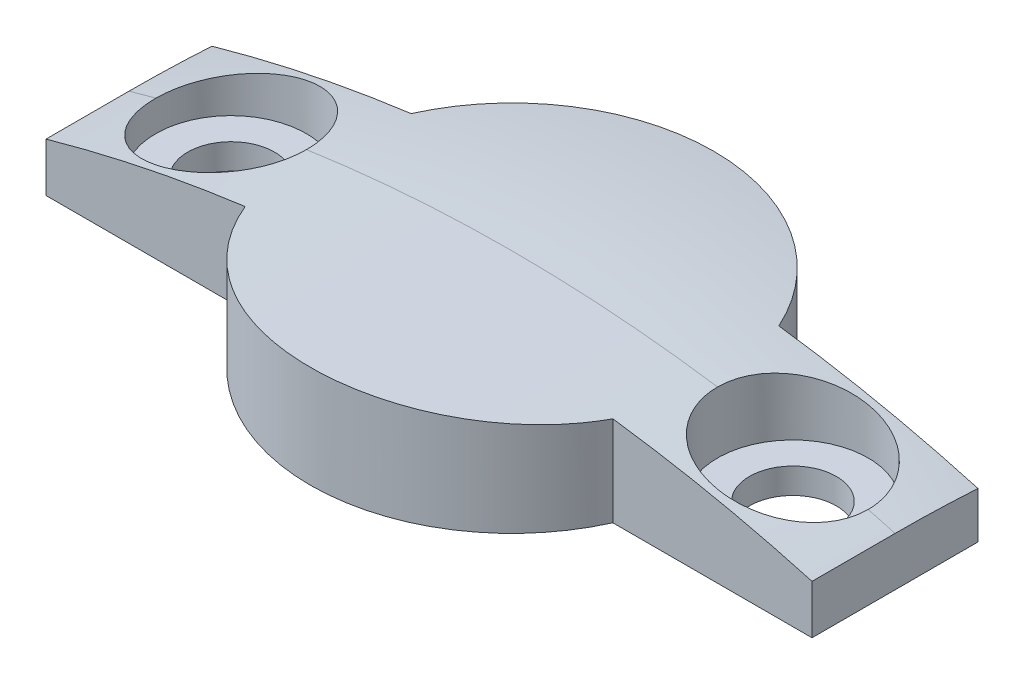
ISO-10303-21;
HEADER;
FILE_DESCRIPTION(('STEP AP214'),'2;1');
FILE_NAME('part.step','',(''),(''),'','','');
FILE_SCHEMA(('AUTOMOTIVE_DESIGN { 1 0 10303 214 1 1 1 1 }'));
ENDSEC;
DATA;
#1=APPLICATION_CONTEXT('core data for automotive mechanical design processes');
#2=APPLICATION_PROTOCOL_DEFINITION('international standard','automotive_design',2000,#1);
#3=PRODUCT_CONTEXT('',#1,'mechanical');
#4=PRODUCT('Part','Part','',(#3));
#5=PRODUCT_RELATED_PRODUCT_CATEGORY('part','',(#4));
#6=PRODUCT_DEFINITION_FORMATION('','',#4);
#7=PRODUCT_DEFINITION_CONTEXT('part definition',#1,'design');
#8=PRODUCT_DEFINITION('design','',#6,#7);
#9=PRODUCT_DEFINITION_SHAPE('','',#8);
#10=(LENGTH_UNIT() NAMED_UNIT(*) SI_UNIT(.MILLI.,.METRE.));
#11=(NAMED_UNIT(*) PLANE_ANGLE_UNIT() SI_UNIT($,.RADIAN.));
#12=(NAMED_UNIT(*) SI_UNIT($,.STERADIAN.) SOLID_ANGLE_UNIT());
#13=UNCERTAINTY_MEASURE_WITH_UNIT(LENGTH_MEASURE(1.E-05),#10,'distance_accuracy_value','');
#14=(GEOMETRIC_REPRESENTATION_CONTEXT(3) GLOBAL_UNCERTAINTY_ASSIGNED_CONTEXT((#13)) GLOBAL_UNIT_ASSIGNED_CONTEXT((#10,
#11,#12)) REPRESENTATION_CONTEXT('',''));
#15=CARTESIAN_POINT('',(0.,0.,0.));
#16=DIRECTION('',(0.,0.,1.));
#17=DIRECTION('',(1.,0.,0.));
#18=AXIS2_PLACEMENT_3D('',#15,#16,#17);
#19=CARTESIAN_POINT('',(-15.,4.,3.25));
#20=DIRECTION('',(1.,0.,0.));
#21=DIRECTION('',(0.,0.,-1.));
#22=AXIS2_PLACEMENT_3D('',#19,#20,#21);
#23=PLANE('',#22);
#24=CARTESIAN_POINT('',(-15.,-51.,0.));
#25=DIRECTION('',(1.,0.,0.));
#26=DIRECTION('',(0.,0.,-1.));
#27=AXIS2_PLACEMENT_3D('',#24,#25,#26);
#28=CIRCLE('',#27,52.9150262212918);
#29=CARTESIAN_POINT('',(-15.,1.81512567437476,-3.25));
#30=VERTEX_POINT('',#29);
#31=CARTESIAN_POINT('',(-15.,1.91502622129181,0.));
#32=VERTEX_POINT('',#31);
#33=EDGE_CURVE('E152',#30,#32,#28,.T.);
#34=ORIENTED_EDGE('',*,*,#33,.F.);
#35=DIRECTION('',(0.,-1.,0.));
#36=VECTOR('',#35,1.);
#37=CARTESIAN_POINT('',(-15.,4.,-3.25));
#38=LINE('',#37,#36);
#39=CARTESIAN_POINT('',(-15.,0.,-3.25));
#40=VERTEX_POINT('',#39);
#41=EDGE_CURVE('E210',#30,#40,#38,.T.);
#42=ORIENTED_EDGE('',*,*,#41,.T.);
#43=DIRECTION('',(0.,0.,1.));
#44=VECTOR('',#43,1.);
#45=CARTESIAN_POINT('',(-15.,0.,3.25));
#46=LINE('',#45,#44);
#47=CARTESIAN_POINT('',(-15.,0.,3.25));
#48=VERTEX_POINT('',#47);
#49=EDGE_CURVE('E174',#40,#48,#46,.T.);
#50=ORIENTED_EDGE('',*,*,#49,.T.);
#51=DIRECTION('',(0.,-1.,0.));
#52=VECTOR('',#51,1.);
#53=CARTESIAN_POINT('',(-15.,4.,3.25));
#54=LINE('',#53,#52);
#55=CARTESIAN_POINT('',(-15.,1.91502622129181,3.25));
#56=VERTEX_POINT('',#55);
#57=EDGE_CURVE('E230',#56,#48,#54,.T.);
#58=ORIENTED_EDGE('',*,*,#57,.F.);
#59=DIRECTION('',(0.,0.,1.));
#60=VECTOR('',#59,1.);
#61=CARTESIAN_POINT('',(-15.,1.91502622129181,21.725989645027));
#62=LINE('',#61,#60);
#63=EDGE_CURVE('E286',#32,#56,#62,.T.);
#64=ORIENTED_EDGE('',*,*,#63,.F.);
#65=EDGE_LOOP('',(#34,#42,#50,#58,#64));
#66=FACE_BOUND('',#65,.T.);
#67=ADVANCED_FACE('F39',(#66),#23,.F.);
#68=CARTESIAN_POINT('',(-7.20052081449669,4.,3.25));
#69=DIRECTION('',(0.,0.,-1.));
#70=DIRECTION('',(-1.,0.,0.));
#71=AXIS2_PLACEMENT_3D('',#68,#69,#70);
#72=PLANE('',#71);
#73=CARTESIAN_POINT('',(0.,-51.,3.25));
#74=DIRECTION('',(0.,0.,-1.));
#75=DIRECTION('',(-1.,0.,0.));
#76=AXIS2_PLACEMENT_3D('',#73,#74,#75);
#77=CIRCLE('',#76,55.);
#78=CARTESIAN_POINT('',(-7.20052081449669,3.52662193827893,3.25));
#79=VERTEX_POINT('',#78);
#80=EDGE_CURVE('E292',#56,#79,#77,.T.);
#81=ORIENTED_EDGE('',*,*,#80,.F.);
#82=ORIENTED_EDGE('',*,*,#57,.T.);
#83=DIRECTION('',(1.,0.,0.));
#84=VECTOR('',#83,1.);
#85=CARTESIAN_POINT('',(-7.20052081449669,0.,3.25));
#86=LINE('',#85,#84);
#87=CARTESIAN_POINT('',(-7.20052081449669,0.,3.24999999999999));
#88=VERTEX_POINT('',#87);
#89=EDGE_CURVE('E183',#48,#88,#86,.T.);
#90=ORIENTED_EDGE('',*,*,#89,.T.);
#91=DIRECTION('',(0.,-1.,0.));
#92=VECTOR('',#91,1.);
#93=CARTESIAN_POINT('',(-7.20052081449669,4.,3.24999999999999));
#94=LINE('',#93,#92);
#95=EDGE_CURVE('E227',#79,#88,#94,.T.);
#96=ORIENTED_EDGE('',*,*,#95,.F.);
#97=EDGE_LOOP('',(#81,#82,#90,#96));
#98=FACE_BOUND('',#97,.T.);
#99=ADVANCED_FACE('F310',(#98),#72,.F.);
#100=CARTESIAN_POINT('',(0.,4.,0.));
#101=DIRECTION('',(0.,-1.,0.));
#102=DIRECTION('',(0.,0.,-1.));
#103=AXIS2_PLACEMENT_3D('',#100,#101,#102);
#104=CYLINDRICAL_SURFACE('',#103,7.9);
#105=CARTESIAN_POINT('',(-7.20052081449669,3.52662193827893,3.25));
#106=CARTESIAN_POINT('',(-7.10892933307068,3.53871267946528,3.45298082942461));
#107=CARTESIAN_POINT('',(-7.00873825517564,3.55171307594968,3.65201756219289));
#108=CARTESIAN_POINT('',(-6.79198193762158,3.57912638849703,4.04084420545848));
#109=CARTESIAN_POINT('',(-6.67541801523197,3.59353919089735,4.23063485819191));
#110=CARTESIAN_POINT('',(-6.42680746034521,3.62336283278068,4.59952298712499));
#111=CARTESIAN_POINT('',(-6.29477101475349,3.63877301264421,4.77862738307223));
#112=CARTESIAN_POINT('',(-6.01609576883491,3.67015873150038,5.12503653674881));
#113=CARTESIAN_POINT('',(-5.86945699231025,3.68613426957145,5.29234131371108));
#114=CARTESIAN_POINT('',(-5.56257866333644,3.71820093139533,5.61401283283452));
#115=CARTESIAN_POINT('',(-5.40233696229129,3.73429207303907,5.76837752341408));
#116=CARTESIAN_POINT('',(-5.06932769329573,3.76613824274754,6.06311601490023));
#117=CARTESIAN_POINT('',(-4.8965555232747,3.78189314454364,6.20348463005337));
#118=CARTESIAN_POINT('',(-4.5398044727223,3.81260995682263,6.46912796690498));
#119=CARTESIAN_POINT('',(-4.35582970185931,3.82757215438646,6.59440817414911));
#120=CARTESIAN_POINT('',(-3.97789644482751,3.85628722572098,6.82904177405816));
#121=CARTESIAN_POINT('',(-3.78393785998935,3.87004008753625,6.938395009277));
#122=CARTESIAN_POINT('',(-3.38734177642489,3.89595076744591,7.14040992509419));
#123=CARTESIAN_POINT('',(-3.18470183582047,3.90810813280216,7.23306687072316));
#124=CARTESIAN_POINT('',(-2.77222213300346,3.93047824206728,7.40097074128448));
#125=CARTESIAN_POINT('',(-2.56238219531649,3.94069093854197,7.47621724155242));
#126=CARTESIAN_POINT('',(-2.13702920178557,3.95887927229919,7.6087266602855));
#127=CARTESIAN_POINT('',(-1.92151678232436,3.96685515936402,7.66599158682069));
#128=CARTESIAN_POINT('',(-1.48627331638825,3.98034565378057,7.76213100305915));
#129=CARTESIAN_POINT('',(-1.26654084763559,3.98585941558506,7.80099917519202));
#130=CARTESIAN_POINT('',(-0.82647841481528,3.99422639166739,7.85975668860282));
#131=CARTESIAN_POINT('',(-0.606170834396561,3.99710265463107,7.87981048220125));
#132=CARTESIAN_POINT('',(-0.16462828619901,4.00019671547024,7.90137669480423));
#133=CARTESIAN_POINT('',(0.0566066912141947,4.00041448565886,7.90288892070763));
#134=CARTESIAN_POINT('',(0.498394449817312,3.99818538604094,7.8873604039125));
#135=CARTESIAN_POINT('',(0.718947279762881,3.99573871130262,7.87032101940659));
#136=CARTESIAN_POINT('',(1.15780923681034,3.98825005514287,7.81782052054378));
#137=CARTESIAN_POINT('',(1.37611831729657,3.98320801991152,7.78235902423882));
#138=CARTESIAN_POINT('',(1.80781912769326,3.97070297706149,7.69351069661142));
#139=CARTESIAN_POINT('',(2.02123031071326,3.96325249618051,7.64021656657908));
#140=CARTESIAN_POINT('',(2.44285829642215,3.94612796297683,7.5160333955143));
#141=CARTESIAN_POINT('',(2.65107328365365,3.93645314524153,7.44513829717181));
#142=CARTESIAN_POINT('',(3.06071303050216,3.91515356629279,7.28630756217148));
#143=CARTESIAN_POINT('',(3.26214006924652,3.90352946756587,7.19837771340656));
#144=CARTESIAN_POINT('',(3.65696234462472,3.87864586976735,7.00605898057262));
#145=CARTESIAN_POINT('',(3.85035459884319,3.86538577055515,6.90166405262051));
#146=CARTESIAN_POINT('',(4.22887592957763,3.83751316794078,6.67648147318121));
#147=CARTESIAN_POINT('',(4.41394641119109,3.82289279724132,6.55559630002772));
#148=CARTESIAN_POINT('',(4.77326833246192,3.79277709195863,6.29878370267967));
#149=CARTESIAN_POINT('',(4.94751954376429,3.77728173892092,6.16285596116017));
#150=CARTESIAN_POINT('',(5.28397620106914,3.74585049724975,5.87693202798796));
#151=CARTESIAN_POINT('',(5.44618349891637,3.72991467686079,5.72693800719383));
#152=CARTESIAN_POINT('',(5.75747001675258,3.69804403525933,5.41389445279864));
#153=CARTESIAN_POINT('',(5.90654983075194,3.68210921403426,5.25084551056264));
#154=CARTESIAN_POINT('',(6.16490381189636,3.65352389999387,4.94334840043145));
#155=CARTESIAN_POINT('',(6.27650601749102,3.64079971521568,4.80085446003523));
#156=CARTESIAN_POINT('',(6.48968522639823,3.61589051987319,4.50851507419616));
#157=CARTESIAN_POINT('',(6.59126286931065,3.60370547493742,4.35867009868784));
#158=CARTESIAN_POINT('',(6.78384261080779,3.5801145414542,4.05242694193478));
#159=CARTESIAN_POINT('',(6.87485232640313,3.56870809419439,3.89603359256038));
#160=CARTESIAN_POINT('',(7.04597292241326,3.54687568915708,3.57729393987092));
#161=CARTESIAN_POINT('',(7.12608194387495,3.53644989870955,3.41494662717291));
#162=CARTESIAN_POINT('',(7.20052081449669,3.52662193827892,3.25));
#163=B_SPLINE_CURVE_WITH_KNOTS('',3,(#105,#106,#107,#108,#109,#110,#111,#112,#113,#114,#115,
#116,#117,#118,#119,#120,#121,#122,#123,#124,#125,#126,#127,#128,#129,#130,#131,#132,#133,#134,
#135,#136,#137,#138,#139,#140,#141,#142,#143,#144,#145,#146,#147,#148,#149,#150,#151,#152,#153,
#154,#155,#156,#157,#158,#159,#160,#161,#162),.UNSPECIFIED.,.F.,.F.,(4,2,2,2,2,2,2,2,2,2,2,2,2,
2,2,2,2,2,2,2,2,2,2,2,2,2,2,2,4),(0.,0.668837429769156,1.33762107933075,2.0059668586106,
2.67431154848736,3.34276200122433,4.01145921154448,4.67991257151661,5.34837253903617,
6.01702178053332,6.68568732957478,7.35427817963758,8.02309846205382,8.68601672664661,
9.34894189519523,10.0118185332113,10.6747089152839,11.3342055170579,11.9939293975997,
12.6534295158087,13.3131722844396,13.9770010765929,14.6408438749707,15.3045843901068,
15.9682948559522,16.5122139583908,17.0560983345456,17.5995882311397,18.1431706960965),.UNSPECIFIED.);
#164=CARTESIAN_POINT('',(7.20052081449669,3.52662193827893,3.25));
#165=VERTEX_POINT('',#164);
#166=EDGE_CURVE('E136',#79,#165,#163,.T.);
#167=ORIENTED_EDGE('',*,*,#166,.F.);
#168=ORIENTED_EDGE('',*,*,#95,.T.);
#169=CARTESIAN_POINT('',(0.,0.,0.));
#170=DIRECTION('',(0.,1.,0.));
#171=DIRECTION('',(0.,0.,1.));
#172=AXIS2_PLACEMENT_3D('',#169,#170,#171);
#173=CIRCLE('',#172,7.9);
#174=CARTESIAN_POINT('',(7.20052081449668,0.,3.25));
#175=VERTEX_POINT('',#174);
#176=EDGE_CURVE('E187',#88,#175,#173,.T.);
#177=ORIENTED_EDGE('',*,*,#176,.T.);
#178=DIRECTION('',(0.,-1.,0.));
#179=VECTOR('',#178,1.);
#180=CARTESIAN_POINT('',(7.20052081449668,4.,3.25));
#181=LINE('',#180,#179);
#182=EDGE_CURVE('E224',#165,#175,#181,.T.);
#183=ORIENTED_EDGE('',*,*,#182,.F.);
#184=EDGE_LOOP('',(#167,#168,#177,#183));
#185=FACE_BOUND('',#184,.T.);
#186=ADVANCED_FACE('F321',(#185),#104,.T.);
#187=CARTESIAN_POINT('',(15.,4.,3.25));
#188=DIRECTION('',(0.,0.,-1.));
#189=DIRECTION('',(-1.,0.,0.));
#190=AXIS2_PLACEMENT_3D('',#187,#188,#189);
#191=PLANE('',#190);
#192=CARTESIAN_POINT('',(0.,-51.,3.25));
#193=DIRECTION('',(0.,0.,-1.));
#194=DIRECTION('',(-1.,0.,0.));
#195=AXIS2_PLACEMENT_3D('',#192,#193,#194);
#196=CIRCLE('',#195,55.);
#197=CARTESIAN_POINT('',(15.,1.91502622129181,3.25));
#198=VERTEX_POINT('',#197);
#199=EDGE_CURVE('E131',#165,#198,#196,.T.);
#200=ORIENTED_EDGE('',*,*,#199,.F.);
#201=ORIENTED_EDGE('',*,*,#182,.T.);
#202=DIRECTION('',(1.,0.,0.));
#203=VECTOR('',#202,1.);
#204=CARTESIAN_POINT('',(15.,0.,3.25));
#205=LINE('',#204,#203);
#206=CARTESIAN_POINT('',(15.,0.,3.25));
#207=VERTEX_POINT('',#206);
#208=EDGE_CURVE('E191',#175,#207,#205,.T.);
#209=ORIENTED_EDGE('',*,*,#208,.T.);
#210=DIRECTION('',(0.,-1.,0.));
#211=VECTOR('',#210,1.);
#212=CARTESIAN_POINT('',(15.,4.,3.25));
#213=LINE('',#212,#211);
#214=EDGE_CURVE('E221',#198,#207,#213,.T.);
#215=ORIENTED_EDGE('',*,*,#214,.F.);
#216=EDGE_LOOP('',(#200,#201,#209,#215));
#217=FACE_BOUND('',#216,.T.);
#218=ADVANCED_FACE('F323',(#217),#191,.F.);
#219=CARTESIAN_POINT('',(15.,4.,3.25));
#220=DIRECTION('',(-1.,0.,0.));
#221=DIRECTION('',(0.,0.,1.));
#222=AXIS2_PLACEMENT_3D('',#219,#220,#221);
#223=PLANE('',#222);
#224=CARTESIAN_POINT('',(15.,-51.,0.));
#225=DIRECTION('',(-1.,0.,0.));
#226=DIRECTION('',(0.,0.,1.));
#227=AXIS2_PLACEMENT_3D('',#224,#225,#226);
#228=CIRCLE('',#227,52.9150262212918);
#229=CARTESIAN_POINT('',(15.,1.91502622129181,0.));
#230=VERTEX_POINT('',#229);
#231=CARTESIAN_POINT('',(15.,1.81512567437476,-3.25));
#232=VERTEX_POINT('',#231);
#233=EDGE_CURVE('E139',#230,#232,#228,.T.);
#234=ORIENTED_EDGE('',*,*,#233,.F.);
#235=DIRECTION('',(0.,0.,1.));
#236=VECTOR('',#235,1.);
#237=CARTESIAN_POINT('',(15.,1.91502622129181,21.725989645027));
#238=LINE('',#237,#236);
#239=EDGE_CURVE('E126',#198,#230,#238,.F.);
#240=ORIENTED_EDGE('',*,*,#239,.F.);
#241=ORIENTED_EDGE('',*,*,#214,.T.);
#242=DIRECTION('',(0.,0.,-1.));
#243=VECTOR('',#242,1.);
#244=CARTESIAN_POINT('',(15.,0.,3.25));
#245=LINE('',#244,#243);
#246=CARTESIAN_POINT('',(15.,0.,-3.25));
#247=VERTEX_POINT('',#246);
#248=EDGE_CURVE('E195',#207,#247,#245,.T.);
#249=ORIENTED_EDGE('',*,*,#248,.T.);
#250=DIRECTION('',(0.,-1.,0.));
#251=VECTOR('',#250,1.);
#252=CARTESIAN_POINT('',(15.,4.,-3.25));
#253=LINE('',#252,#251);
#254=EDGE_CURVE('E150',#232,#247,#253,.T.);
#255=ORIENTED_EDGE('',*,*,#254,.F.);
#256=EDGE_LOOP('',(#234,#240,#241,#249,#255));
#257=FACE_BOUND('',#256,.T.);
#258=ADVANCED_FACE('F148',(#257),#223,.F.);
#259=CARTESIAN_POINT('',(15.,4.,-3.25));
#260=DIRECTION('',(0.,0.,1.));
#261=DIRECTION('',(1.,0.,0.));
#262=AXIS2_PLACEMENT_3D('',#259,#260,#261);
#263=PLANE('',#262);
#264=CARTESIAN_POINT('',(0.,-51.,-3.25));
#265=DIRECTION('',(0.,0.,1.));
#266=DIRECTION('',(1.,0.,0.));
#267=AXIS2_PLACEMENT_3D('',#264,#265,#266);
#268=CIRCLE('',#267,54.9038933045736);
#269=CARTESIAN_POINT('',(7.20052081449669,3.42967940379587,-3.25));
#270=VERTEX_POINT('',#269);
#271=EDGE_CURVE('E153',#232,#270,#268,.T.);
#272=ORIENTED_EDGE('',*,*,#271,.F.);
#273=ORIENTED_EDGE('',*,*,#254,.T.);
#274=DIRECTION('',(-1.,0.,0.));
#275=VECTOR('',#274,1.);
#276=CARTESIAN_POINT('',(15.,0.,-3.25));
#277=LINE('',#276,#275);
#278=CARTESIAN_POINT('',(7.20052081449669,0.,-3.25));
#279=VERTEX_POINT('',#278);
#280=EDGE_CURVE('E198',#247,#279,#277,.T.);
#281=ORIENTED_EDGE('',*,*,#280,.T.);
#282=DIRECTION('',(0.,-1.,0.));
#283=VECTOR('',#282,1.);
#284=CARTESIAN_POINT('',(7.20052081449669,4.,-3.25));
#285=LINE('',#284,#283);
#286=EDGE_CURVE('E216',#270,#279,#285,.T.);
#287=ORIENTED_EDGE('',*,*,#286,.F.);
#288=EDGE_LOOP('',(#272,#273,#281,#287));
#289=FACE_BOUND('',#288,.T.);
#290=ADVANCED_FACE('F328',(#289),#263,.F.);
#291=CARTESIAN_POINT('',(0.,4.,0.));
#292=DIRECTION('',(0.,-1.,0.));
#293=DIRECTION('',(0.,0.,-1.));
#294=AXIS2_PLACEMENT_3D('',#291,#292,#293);
#295=CYLINDRICAL_SURFACE('',#294,7.9);
#296=CARTESIAN_POINT('',(0.,3.42967940379587,0.));
#297=DIRECTION('',(0.,-1.,0.));
#298=DIRECTION('',(0.,0.,-1.));
#299=AXIS2_PLACEMENT_3D('',#296,#297,#298);
#300=CIRCLE('',#299,7.9);
#301=CARTESIAN_POINT('',(-7.20052081449669,3.42967940379586,-3.25));
#302=VERTEX_POINT('',#301);
#303=EDGE_CURVE('E60',#270,#302,#300,.F.);
#304=ORIENTED_EDGE('',*,*,#303,.F.);
#305=ORIENTED_EDGE('',*,*,#286,.T.);
#306=CARTESIAN_POINT('',(0.,0.,0.));
#307=DIRECTION('',(0.,1.,0.));
#308=DIRECTION('',(0.,0.,1.));
#309=AXIS2_PLACEMENT_3D('',#306,#307,#308);
#310=CIRCLE('',#309,7.9);
#311=CARTESIAN_POINT('',(-7.20052081449669,0.,-3.25));
#312=VERTEX_POINT('',#311);
#313=EDGE_CURVE('E202',#279,#312,#310,.T.);
#314=ORIENTED_EDGE('',*,*,#313,.T.);
#315=DIRECTION('',(0.,-1.,0.));
#316=VECTOR('',#315,1.);
#317=CARTESIAN_POINT('',(-7.20052081449669,4.,-3.25));
#318=LINE('',#317,#316);
#319=EDGE_CURVE('E213',#302,#312,#318,.T.);
#320=ORIENTED_EDGE('',*,*,#319,.F.);
#321=EDGE_LOOP('',(#304,#305,#314,#320));
#322=FACE_BOUND('',#321,.T.);
#323=ADVANCED_FACE('F331',(#322),#295,.T.);
#324=CARTESIAN_POINT('',(-7.20052081449669,4.,-3.25));
#325=DIRECTION('',(0.,0.,1.));
#326=DIRECTION('',(1.,0.,0.));
#327=AXIS2_PLACEMENT_3D('',#324,#325,#326);
#328=PLANE('',#327);
#329=CARTESIAN_POINT('',(0.,-51.,-3.25));
#330=DIRECTION('',(0.,0.,1.));
#331=DIRECTION('',(1.,0.,0.));
#332=AXIS2_PLACEMENT_3D('',#329,#330,#331);
#333=CIRCLE('',#332,54.9038933045736);
#334=EDGE_CURVE('E285',#302,#30,#333,.T.);
#335=ORIENTED_EDGE('',*,*,#334,.F.);
#336=ORIENTED_EDGE('',*,*,#319,.T.);
#337=DIRECTION('',(-1.,0.,0.));
#338=VECTOR('',#337,1.);
#339=CARTESIAN_POINT('',(-7.20052081449669,0.,-3.25));
#340=LINE('',#339,#338);
#341=EDGE_CURVE('E206',#312,#40,#340,.T.);
#342=ORIENTED_EDGE('',*,*,#341,.T.);
#343=ORIENTED_EDGE('',*,*,#41,.F.);
#344=EDGE_LOOP('',(#335,#336,#342,#343));
#345=FACE_BOUND('',#344,.T.);
#346=ADVANCED_FACE('F271',(#345),#328,.F.);
#347=CARTESIAN_POINT('',(-11.,1.,0.));
#348=DIRECTION('',(0.,1.,0.));
#349=DIRECTION('',(0.,0.,1.));
#350=AXIS2_PLACEMENT_3D('',#347,#348,#349);
#351=CYLINDRICAL_SURFACE('',#350,2.95);
#352=CARTESIAN_POINT('',(-11.,1.,0.));
#353=DIRECTION('',(0.,1.,0.));
#354=DIRECTION('',(0.,0.,1.));
#355=AXIS2_PLACEMENT_3D('',#352,#353,#354);
#356=CIRCLE('',#355,2.95);
#357=CARTESIAN_POINT('',(-11.,1.,2.95));
#358=VERTEX_POINT('',#357);
#359=EDGE_CURVE('E162',#358,#358,#356,.T.);
#360=ORIENTED_EDGE('',*,*,#359,.F.);
#361=EDGE_LOOP('',(#360));
#362=FACE_BOUND('',#361,.T.);
#363=CARTESIAN_POINT('',(-13.9499999932203,2.20148024396645,0.000199999999999988));
#364=CARTESIAN_POINT('',(-13.9500143793869,2.20147721144173,-0.0815289670688059));
#365=CARTESIAN_POINT('',(-13.9466147392955,2.20218018156275,-0.163253862727753));
#366=CARTESIAN_POINT('',(-13.9330556013263,2.20498360467265,-0.326109691324551));
#367=CARTESIAN_POINT('',(-13.9228967107128,2.20708393212022,-0.407240676958494));
#368=CARTESIAN_POINT('',(-13.8959045931903,2.21266396567041,-0.568234282201102));
#369=CARTESIAN_POINT('',(-13.8790799570637,2.21614189632297,-0.648098397296882));
#370=CARTESIAN_POINT('',(-13.8389077072492,2.22444501850554,-0.806073900158508));
#371=CARTESIAN_POINT('',(-13.8155601202855,2.22927020451591,-0.884185295103753));
#372=CARTESIAN_POINT('',(-13.7359616220267,2.24571782181527,-1.11510668903725));
#373=CARTESIAN_POINT('',(-13.6701377403917,2.25931587737344,-1.26460585583815));
#374=CARTESIAN_POINT('',(-13.5150949197148,2.29132824529451,-1.55024089977089));
#375=CARTESIAN_POINT('',(-13.4258767908251,2.30974239087421,-1.68637723943846));
#376=CARTESIAN_POINT('',(-13.2257831665228,2.35101403757995,-1.94295623731438));
#377=CARTESIAN_POINT('',(-13.1147185269851,2.37391033562926,-2.0632453080618));
#378=CARTESIAN_POINT('',(-12.8747056369936,2.42335244195798,-2.28353451686057));
#379=CARTESIAN_POINT('',(-12.7457534785251,2.44989904773525,-2.38353020948123));
#380=CARTESIAN_POINT('',(-12.4709449276082,2.50642507747701,-2.56246425467045));
#381=CARTESIAN_POINT('',(-12.324807479537,2.5364614393376,-2.64095300449766));
#382=CARTESIAN_POINT('',(-12.0218653881034,2.59867002493081,-2.77228322283303));
#383=CARTESIAN_POINT('',(-11.8650603020131,2.63084233730825,-2.82512362614316));
#384=CARTESIAN_POINT('',(-11.5421368196058,2.69703534122329,-2.90460631991368));
#385=CARTESIAN_POINT('',(-11.3759003208929,2.73107911793124,-2.93075005909331));
#386=CARTESIAN_POINT('',(-11.0414609823659,2.79950305609478,-2.95446952418765));
#387=CARTESIAN_POINT('',(-10.8732579616417,2.83388324845073,-2.95204260075376));
#388=CARTESIAN_POINT('',(-10.5380267069855,2.90233849094292,-2.9185124493733));
#389=CARTESIAN_POINT('',(-10.3710236586973,2.93640779288851,-2.88714466121818));
#390=CARTESIAN_POINT('',(-10.0445662448825,3.00294575469703,-2.79613297113232));
#391=CARTESIAN_POINT('',(-9.8851118466893,3.03541442148672,-2.73648919157806));
#392=CARTESIAN_POINT('',(-9.57900505482259,3.09769270274096,-2.59073310034193));
#393=CARTESIAN_POINT('',(-9.43230555713591,3.12751211071551,-2.50472399501361));
#394=CARTESIAN_POINT('',(-9.15542753297029,3.18375112681731,-2.3084282504103));
#395=CARTESIAN_POINT('',(-9.02524699774058,3.21017114832466,-2.19814456745868));
#396=CARTESIAN_POINT('',(-8.787298494911,3.25843259680417,-1.95820377144027));
#397=CARTESIAN_POINT('',(-8.67921545753842,3.28033842994588,-1.82887214185874));
#398=CARTESIAN_POINT('',(-8.48634053814465,3.31941081559046,-1.55316144219824));
#399=CARTESIAN_POINT('',(-8.4015535669075,3.33657636885162,-1.40677878702877));
#400=CARTESIAN_POINT('',(-8.25945158245021,3.36533609580274,-1.10422568583936));
#401=CARTESIAN_POINT('',(-8.20164024195259,3.37703093672776,-0.948297205255498));
#402=CARTESIAN_POINT('',(-8.11304502727378,3.39495005170928,-0.628787660639243));
#403=CARTESIAN_POINT('',(-8.08221584619925,3.40118349624787,-0.465219912516979));
#404=CARTESIAN_POINT('',(-8.06021671464717,3.40563144116556,-0.250429033122879));
#405=CARTESIAN_POINT('',(-8.05638068403909,3.40640702165969,-0.2003402833859));
#406=CARTESIAN_POINT('',(-8.05127420346542,3.40743945469579,-0.100107898304989));
#407=CARTESIAN_POINT('',(-8.04999961914818,3.40769714315142,-0.0499644823241709));
#408=CARTESIAN_POINT('',(-8.05000000677966,3.40769706439381,0.000199999999999929));
#409=B_SPLINE_CURVE_WITH_KNOTS('',3,(#363,#364,#365,#366,#367,#368,#369,#370,#371,#372,#373,
#374,#375,#376,#377,#378,#379,#380,#381,#382,#383,#384,#385,#386,#387,#388,#389,#390,#391,#392,
#393,#394,#395,#396,#397,#398,#399,#400,#401,#402,#403,#404,#405,#406,#407,#408),.UNSPECIFIED.,
.F.,.F.,(4,2,2,2,2,2,2,2,2,2,2,2,2,2,2,2,2,2,2,2,2,2,4),(0.,0.245105330518067,0.490188643268912,
0.734957115928842,0.979724585798291,1.46895303791877,1.95816455009846,2.45181446385765,
2.9455723992251,3.44897762893489,3.9524037637114,4.46506818596224,4.97778014779882,
5.49522595733342,6.01266952741971,6.52811289940487,7.04349353188483,7.55091517605104,
8.05844370219738,8.55622513306347,9.05316910540555,9.20384671961335,9.35428093375512),.UNSPECIFIED.);
#410=CARTESIAN_POINT('',(-13.95,2.20148024256468,0.));
#411=VERTEX_POINT('',#410);
#412=CARTESIAN_POINT('',(-8.05,3.40769706576451,0.));
#413=VERTEX_POINT('',#412);
#414=EDGE_CURVE('E277',#411,#413,#409,.T.);
#415=ORIENTED_EDGE('',*,*,#414,.F.);
#416=CARTESIAN_POINT('',(-8.05,3.40769706576451,0.));
#417=CARTESIAN_POINT('',(-8.04999159944331,3.40769691427624,0.0822490715707013));
#418=CARTESIAN_POINT('',(-8.05343973162025,3.40718809703661,0.16449421322486));
#419=CARTESIAN_POINT('',(-8.06718423339113,3.40515257712504,0.32839263055902));
#420=CARTESIAN_POINT('',(-8.07748017701344,3.40362593776723,0.410045942734715));
#421=CARTESIAN_POINT('',(-8.1048427383,3.39955611626435,0.572111551857416));
#422=CARTESIAN_POINT('',(-8.12190304001028,3.39701388237416,0.652524933982193));
#423=CARTESIAN_POINT('',(-8.16264766326614,3.39091471448304,0.811592321019425));
#424=CARTESIAN_POINT('',(-8.18633192095323,3.38735779026426,0.890246342885161));
#425=CARTESIAN_POINT('',(-8.26710897049493,3.37515906141859,1.12279880160956));
#426=CARTESIAN_POINT('',(-8.33393960059146,3.36498732962078,1.27336741164972));
#427=CARTESIAN_POINT('',(-8.49145196618888,3.34060681639279,1.56096276515092));
#428=CARTESIAN_POINT('',(-8.58213017479976,3.3263986319008,1.69799150694453));
#429=CARTESIAN_POINT('',(-8.78502613041163,3.29395803200755,1.95533020270265));
#430=CARTESIAN_POINT('',(-8.8973194552977,3.27571146171077,2.07557886188342));
#431=CARTESIAN_POINT('',(-9.13991961730681,3.23538477562705,2.29552235368403));
#432=CARTESIAN_POINT('',(-9.27022977461058,3.21330395306344,2.39521338944479));
#433=CARTESIAN_POINT('',(-9.54648422721274,3.16534373906344,2.57235070189931));
#434=CARTESIAN_POINT('',(-9.69257533554121,3.13942766664117,2.64955802029524));
#435=CARTESIAN_POINT('',(-9.99504647864712,3.08440310694093,2.77841647540666));
#436=CARTESIAN_POINT('',(-10.1514266400165,3.05529458038148,2.83006729761973));
#437=CARTESIAN_POINT('',(-10.4725659219183,2.99400405883949,2.90723257690175));
#438=CARTESIAN_POINT('',(-10.6374170313433,2.96178161134514,2.9323319726343));
#439=CARTESIAN_POINT('',(-10.9686189731543,2.89543515310736,2.9545001442355));
#440=CARTESIAN_POINT('',(-11.1349699855672,2.86131091148286,2.95156550932295));
#441=CARTESIAN_POINT('',(-11.4672609212616,2.79155326384986,2.91761883106298));
#442=CARTESIAN_POINT('',(-11.6331521046139,2.75590447807051,2.88616037088498));
#443=CARTESIAN_POINT('',(-11.9571986038765,2.6847552064954,2.79545776346773));
#444=CARTESIAN_POINT('',(-12.11535339447,2.64925473091949,2.73621173227957));
#445=CARTESIAN_POINT('',(-12.4206116908337,2.57940943525239,2.59097162405674));
#446=CARTESIAN_POINT('',(-12.5676278289494,2.54507472617376,2.50478881051489));
#447=CARTESIAN_POINT('',(-12.8450598982132,2.47919963480671,2.30806507026631));
#448=CARTESIAN_POINT('',(-12.9754771053314,2.4476590377899,2.19752601762506));
#449=CARTESIAN_POINT('',(-13.2144379810207,2.38907784978075,1.95634144963129));
#450=CARTESIAN_POINT('',(-13.3232032026321,2.36199223127862,1.82592660397334));
#451=CARTESIAN_POINT('',(-13.5171579379429,2.31319238941095,1.54763294388282));
#452=CARTESIAN_POINT('',(-13.6023433957109,2.29147909020073,1.39975113120844));
#453=CARTESIAN_POINT('',(-13.7442725097872,2.25504877976585,1.09498680402735));
#454=CARTESIAN_POINT('',(-13.8017112740687,2.24016131660324,0.938447518442568));
#455=CARTESIAN_POINT('',(-13.8893974073233,2.21735368275126,0.617599490126873));
#456=CARTESIAN_POINT('',(-13.9196943604257,2.20942080761438,0.453305494755996));
#457=CARTESIAN_POINT('',(-13.9406223316103,2.2039383100218,0.239935642777048));
#458=CARTESIAN_POINT('',(-13.9441404502064,2.2030163335567,0.191981033002685));
#459=CARTESIAN_POINT('',(-13.9488259497056,2.20178818872947,0.0960242486693861));
#460=CARTESIAN_POINT('',(-13.9499969929418,2.20148106096957,0.0480222653295203));
#461=CARTESIAN_POINT('',(-13.95,2.20148024256467,0.));
#462=B_SPLINE_CURVE_WITH_KNOTS('',3,(#416,#417,#418,#419,#420,#421,#422,#423,#424,#425,#426,
#427,#428,#429,#430,#431,#432,#433,#434,#435,#436,#437,#438,#439,#440,#441,#442,#443,#444,#445,
#446,#447,#448,#449,#450,#451,#452,#453,#454,#455,#456,#457,#458,#459,#460,#461),.UNSPECIFIED.,
.F.,.F.,(4,2,2,2,2,2,2,2,2,2,2,2,2,2,2,2,2,2,2,2,2,2,4),(0.,0.246666351177186,0.493317359782429,
0.739738607982591,0.98615748063188,1.47875544048919,1.97128058948315,2.46556022055851,
2.9599310602582,3.45937888333604,3.95883285254773,4.46598402933837,4.97319690984005,
5.4884876691516,6.00381336932996,6.52283393073698,7.04181457058394,7.55517576416614,
8.06862520569491,8.56844201529091,9.06734385942323,9.21158010066772,9.35559110256061),.UNSPECIFIED.);
#463=EDGE_CURVE('E144',#413,#411,#462,.T.);
#464=ORIENTED_EDGE('',*,*,#463,.F.);
#465=EDGE_LOOP('',(#415,#464));
#466=FACE_BOUND('',#465,.T.);
#467=ADVANCED_FACE('F268',(#362,#466),#351,.F.);
#468=CARTESIAN_POINT('',(11.,1.,0.));
#469=DIRECTION('',(0.,1.,0.));
#470=DIRECTION('',(0.,0.,1.));
#471=AXIS2_PLACEMENT_3D('',#468,#469,#470);
#472=CYLINDRICAL_SURFACE('',#471,2.95);
#473=CARTESIAN_POINT('',(11.,1.,0.));
#474=DIRECTION('',(0.,1.,0.));
#475=DIRECTION('',(0.,0.,1.));
#476=AXIS2_PLACEMENT_3D('',#473,#474,#475);
#477=CIRCLE('',#476,2.95);
#478=CARTESIAN_POINT('',(11.,1.,2.95));
#479=VERTEX_POINT('',#478);
#480=EDGE_CURVE('E157',#479,#479,#477,.T.);
#481=ORIENTED_EDGE('',*,*,#480,.F.);
#482=EDGE_LOOP('',(#481));
#483=FACE_BOUND('',#482,.T.);
#484=CARTESIAN_POINT('',(8.05000000677966,3.40769706439382,0.000199999999999988));
#485=CARTESIAN_POINT('',(8.04998565680661,3.40769991121796,-0.0815740083708548));
#486=CARTESIAN_POINT('',(8.05338900193671,3.4070118852218,-0.163343981328107));
#487=CARTESIAN_POINT('',(8.06696319000741,3.40426741785574,-0.326290224547238));
#488=CARTESIAN_POINT('',(8.07713344240735,3.40221109589554,-0.407466545991526));
#489=CARTESIAN_POINT('',(8.10415663309596,3.39674678826261,-0.568553343343488));
#490=CARTESIAN_POINT('',(8.12100118205192,3.39334049944484,-0.648465277901713));
#491=CARTESIAN_POINT('',(8.16122201833021,3.38520600300704,-0.806535914421897));
#492=CARTESIAN_POINT('',(8.18459827547712,3.38047780149402,-0.884694624481666));
#493=CARTESIAN_POINT('',(8.26429742931295,3.36435480989361,-1.11575843090983));
#494=CARTESIAN_POINT('',(8.33020760539835,3.35101821829942,-1.26535112845131));
#495=CARTESIAN_POINT('',(8.48546229779137,3.31958739453317,-1.55115760461481));
#496=CARTESIAN_POINT('',(8.57480576020699,3.30149337632221,-1.68737198453664));
#497=CARTESIAN_POINT('',(8.77513826261234,3.26089634961851,-1.94401632370084));
#498=CARTESIAN_POINT('',(8.88630643025094,3.23835684691205,-2.06430083785242));
#499=CARTESIAN_POINT('',(9.12653624867064,3.18961427736813,-2.28455838075788));
#500=CARTESIAN_POINT('',(9.25560176467593,3.16341041914298,-2.38452701043583));
#501=CARTESIAN_POINT('',(9.53053108858404,3.10754669622237,-2.56330757466903));
#502=CARTESIAN_POINT('',(9.67666470170213,3.07783119988463,-2.64168723466115));
#503=CARTESIAN_POINT('',(9.97956630054225,3.01618267666734,-2.77280691398604));
#504=CARTESIAN_POINT('',(10.1363347064178,2.98424956217416,-2.82554591964895));
#505=CARTESIAN_POINT('',(10.4591205245417,2.91843793982603,-2.90483476837432));
#506=CARTESIAN_POINT('',(10.6252543216451,2.88453460755702,-2.9308906508724));
#507=CARTESIAN_POINT('',(10.9594500052528,2.81626859114187,-2.95447505610572));
#508=CARTESIAN_POINT('',(11.1275120747158,2.78190586335529,-2.95200084910223));
#509=CARTESIAN_POINT('',(11.4625351009355,2.71334019144448,-2.91842051444782));
#510=CARTESIAN_POINT('',(11.6294689520544,2.67914214639978,-2.88703290137416));
#511=CARTESIAN_POINT('',(11.955771389482,2.61223413799545,-2.7960132060902));
#512=CARTESIAN_POINT('',(12.1151399666025,2.57952417644312,-2.73638108957769));
#513=CARTESIAN_POINT('',(12.4212021042101,2.51665198726171,-2.59062268115386));
#514=CARTESIAN_POINT('',(12.567932847316,2.48648229205561,-2.50457776576519));
#515=CARTESIAN_POINT('',(12.8448623914859,2.42949878451717,-2.3081998792053));
#516=CARTESIAN_POINT('',(12.9750631645667,2.40268457188301,-2.19786980954147));
#517=CARTESIAN_POINT('',(13.2130724026928,2.35363624863662,-1.95779223593974));
#518=CARTESIAN_POINT('',(13.3211912506428,2.33133869491782,-1.82836549293953));
#519=CARTESIAN_POINT('',(13.5141138666468,2.29153209199458,-1.55243684041534));
#520=CARTESIAN_POINT('',(13.5989127785304,2.27402404016553,-1.40593138343094));
#521=CARTESIAN_POINT('',(13.7409626365779,2.24468549850473,-1.10320007028696));
#522=CARTESIAN_POINT('',(13.7987253696701,2.23274954297629,-0.947223845725272));
#523=CARTESIAN_POINT('',(13.8872118719253,2.21446160585666,-0.627615177983866));
#524=CARTESIAN_POINT('',(13.9179812709444,2.20810020099827,-0.463996149475112));
#525=CARTESIAN_POINT('',(13.9398698233467,2.20357473064331,-0.24936810750028));
#526=CARTESIAN_POINT('',(13.9436733646769,2.20278832946504,-0.199490975856888));
#527=CARTESIAN_POINT('',(13.9487365940523,2.20174147000269,-0.0996827407225491));
#528=CARTESIAN_POINT('',(13.9500003699857,2.20148016654582,-0.0497518535945077));
#529=CARTESIAN_POINT('',(13.9499999932203,2.20148024396645,0.000199999999999818));
#530=B_SPLINE_CURVE_WITH_KNOTS('',3,(#484,#485,#486,#487,#488,#489,#490,#491,#492,#493,#494,
#495,#496,#497,#498,#499,#500,#501,#502,#503,#504,#505,#506,#507,#508,#509,#510,#511,#512,#513,
#514,#515,#516,#517,#518,#519,#520,#521,#522,#523,#524,#525,#526,#527,#528,#529),.UNSPECIFIED.,
.F.,.F.,(4,2,2,2,2,2,2,2,2,2,2,2,2,2,2,2,2,2,2,2,2,2,4),(0.,0.245240524166077,0.49045964926468,
0.735371516265411,0.980282251832003,1.46980335311278,1.9593024423751,2.45300108669842,
2.94680651983341,3.44987955410086,3.95297247508814,4.46521897631937,4.97751448933949,
5.49485075524036,6.01218764943428,6.52794638564829,7.04364353418308,7.55149924902386,
8.05946064037968,8.55737317796462,9.05444240734927,9.20448080995897,9.35427752370256),.UNSPECIFIED.);
#531=CARTESIAN_POINT('',(8.05,3.40769706576451,0.));
#532=VERTEX_POINT('',#531);
#533=CARTESIAN_POINT('',(13.95,2.20148024256468,0.));
#534=VERTEX_POINT('',#533);
#535=EDGE_CURVE('E11',#532,#534,#530,.T.);
#536=ORIENTED_EDGE('',*,*,#535,.F.);
#537=CARTESIAN_POINT('',(13.95,2.20148024256468,0.));
#538=CARTESIAN_POINT('',(13.9500093747048,2.20147637655032,0.0811292032096964));
#539=CARTESIAN_POINT('',(13.9466533679549,2.20235772946812,0.16225357280684));
#540=CARTESIAN_POINT('',(13.9332829320047,2.20586165193821,0.323903924387592));
#541=CARTESIAN_POINT('',(13.9232693444632,2.20848400139168,0.404429980709596));
#542=CARTESIAN_POINT('',(13.8966788994569,2.21543473748868,0.564178534206555));
#543=CARTESIAN_POINT('',(13.8801133398735,2.21976018733665,0.643403032074079));
#544=CARTESIAN_POINT('',(13.8405757990557,2.23005612845635,0.800105116778484));
#545=CARTESIAN_POINT('',(13.8176037958574,2.23602662536798,0.87758269762523));
#546=CARTESIAN_POINT('',(13.7393272022091,2.25630325017771,1.10659405216379));
#547=CARTESIAN_POINT('',(13.6746401212237,2.27298031498917,1.25483679202769));
#548=CARTESIAN_POINT('',(13.52239026835,2.31182881829894,1.53816788755584));
#549=CARTESIAN_POINT('',(13.434825014082,2.33400085301156,1.67325481357322));
#550=CARTESIAN_POINT('',(13.2378665321014,2.38323077974863,1.92896111398281));
#551=CARTESIAN_POINT('',(13.1281498064551,2.41036043774937,2.0493177101802));
#552=CARTESIAN_POINT('',(12.8909502965631,2.46810525959609,2.27003807170848));
#553=CARTESIAN_POINT('',(12.7634631256517,2.49872128371504,2.37039688564479));
#554=CARTESIAN_POINT('',(12.4902202987163,2.56318365043322,2.55134736150374));
#555=CARTESIAN_POINT('',(12.3440368335019,2.59709862191213,2.63126895047318));
#556=CARTESIAN_POINT('',(12.0405639145904,2.66608819611924,2.76536697138772));
#557=CARTESIAN_POINT('',(11.8832737697698,2.70116287093874,2.81954179959236));
#558=CARTESIAN_POINT('',(11.5587114299915,2.77196557978817,2.90153228666833));
#559=CARTESIAN_POINT('',(11.3913051101183,2.80769314785886,2.92881859462529));
#560=CARTESIAN_POINT('',(11.0540407493255,2.87799043751786,2.95434952006219));
#561=CARTESIAN_POINT('',(10.8841825928004,2.91256010425362,2.95259276364744));
#562=CARTESIAN_POINT('',(10.5467105196361,2.97959355127756,2.91989541140741));
#563=CARTESIAN_POINT('',(10.3790986512519,3.01205550126984,2.88892980414465));
#564=CARTESIAN_POINT('',(10.0511984425202,3.07403500375904,2.79842747204752));
#565=CARTESIAN_POINT('',(9.89090960239263,3.10355275735384,2.73889270019329));
#566=CARTESIAN_POINT('',(9.58453066630189,3.15866239497293,2.59370545640469));
#567=CARTESIAN_POINT('',(9.43828236335488,3.18430055112447,2.50840454248011));
#568=CARTESIAN_POINT('',(9.16211451832385,3.2316818309258,2.31370066586457));
#569=CARTESIAN_POINT('',(9.03219276032381,3.25342548332684,2.20430097953384));
#570=CARTESIAN_POINT('',(8.79474337763919,3.29241898235172,1.96649581711716));
#571=CARTESIAN_POINT('',(8.6868755927065,3.30973831488509,1.83844128039553));
#572=CARTESIAN_POINT('',(8.49412245233259,3.34021937583695,1.56555932970825));
#573=CARTESIAN_POINT('',(8.40924250644526,3.35338012576899,1.4207279792103));
#574=CARTESIAN_POINT('',(8.266039115156,3.37534185286088,1.12040912747069));
#575=CARTESIAN_POINT('',(8.20740233174079,3.38419438736036,0.965074338004854));
#576=CARTESIAN_POINT('',(8.11702849239737,3.39775704998213,0.646730473745667));
#577=CARTESIAN_POINT('',(8.08524994262237,3.40247356834739,0.483733649015872));
#578=CARTESIAN_POINT('',(8.06155924024613,3.40598564883257,0.266335500002942));
#579=CARTESIAN_POINT('',(8.0572224094506,3.40662800446861,0.213115580416354));
#580=CARTESIAN_POINT('',(8.05144674804399,3.40748311165916,0.106604519117495));
#581=CARTESIAN_POINT('',(8.05000308022051,3.40769658029113,0.0533136456047824));
#582=CARTESIAN_POINT('',(8.05,3.40769706576451,0.));
#583=B_SPLINE_CURVE_WITH_KNOTS('',3,(#537,#538,#539,#540,#541,#542,#543,#544,#545,#546,#547,
#548,#549,#550,#551,#552,#553,#554,#555,#556,#557,#558,#559,#560,#561,#562,#563,#564,#565,#566,
#567,#568,#569,#570,#571,#572,#573,#574,#575,#576,#577,#578,#579,#580,#581,#582),.UNSPECIFIED.,
.F.,.F.,(4,2,2,2,2,2,2,2,2,2,2,2,2,2,2,2,2,2,2,2,2,2,4),(0.,0.24330499909336,0.486579245140541,
0.729435817851161,0.972293223184234,1.45761610696636,1.94299167224255,2.43604828737595,
2.92922683066046,3.43694655153933,3.94469789363771,4.46225667772301,4.97983994521976,
5.49786682019649,6.01585828804351,6.52707905246003,7.03823035646051,7.54077707846835,
8.04344195843227,8.53993362177724,9.03565683532362,9.1958002569649,9.35567570331384),.UNSPECIFIED.);
#584=EDGE_CURVE('E53',#534,#532,#583,.T.);
#585=ORIENTED_EDGE('',*,*,#584,.F.);
#586=EDGE_LOOP('',(#536,#585));
#587=FACE_BOUND('',#586,.T.);
#588=ADVANCED_FACE('F244',(#483,#587),#472,.F.);
#589=CARTESIAN_POINT('',(11.,0.,0.));
#590=DIRECTION('',(0.,1.,0.));
#591=DIRECTION('',(0.,0.,1.));
#592=AXIS2_PLACEMENT_3D('',#589,#590,#591);
#593=CYLINDRICAL_SURFACE('',#592,1.7);
#594=CARTESIAN_POINT('',(11.,0.,0.));
#595=DIRECTION('',(0.,1.,0.));
#596=DIRECTION('',(0.,0.,1.));
#597=AXIS2_PLACEMENT_3D('',#594,#595,#596);
#598=CIRCLE('',#597,1.7);
#599=CARTESIAN_POINT('',(11.,0.,1.7));
#600=VERTEX_POINT('',#599);
#601=EDGE_CURVE('E175',#600,#600,#598,.T.);
#602=ORIENTED_EDGE('',*,*,#601,.F.);
#603=EDGE_LOOP('',(#602));
#604=FACE_BOUND('',#603,.T.);
#605=CARTESIAN_POINT('',(11.,1.,0.));
#606=DIRECTION('',(0.,1.,0.));
#607=DIRECTION('',(0.,0.,1.));
#608=AXIS2_PLACEMENT_3D('',#605,#606,#607);
#609=CIRCLE('',#608,1.7);
#610=CARTESIAN_POINT('',(11.,1.,1.7));
#611=VERTEX_POINT('',#610);
#612=EDGE_CURVE('E179',#611,#611,#609,.F.);
#613=ORIENTED_EDGE('',*,*,#612,.F.);
#614=EDGE_LOOP('',(#613));
#615=FACE_BOUND('',#614,.T.);
#616=ADVANCED_FACE('F381',(#604,#615),#593,.F.);
#617=CARTESIAN_POINT('',(-11.,0.,0.));
#618=DIRECTION('',(0.,1.,0.));
#619=DIRECTION('',(0.,0.,1.));
#620=AXIS2_PLACEMENT_3D('',#617,#618,#619);
#621=CYLINDRICAL_SURFACE('',#620,1.7);
#622=CARTESIAN_POINT('',(-11.,0.,0.));
#623=DIRECTION('',(0.,1.,0.));
#624=DIRECTION('',(0.,0.,1.));
#625=AXIS2_PLACEMENT_3D('',#622,#623,#624);
#626=CIRCLE('',#625,1.7);
#627=CARTESIAN_POINT('',(-11.,0.,1.7));
#628=VERTEX_POINT('',#627);
#629=EDGE_CURVE('E170',#628,#628,#626,.T.);
#630=ORIENTED_EDGE('',*,*,#629,.F.);
#631=EDGE_LOOP('',(#630));
#632=FACE_BOUND('',#631,.T.);
#633=CARTESIAN_POINT('',(-11.,1.,0.));
#634=DIRECTION('',(0.,1.,0.));
#635=DIRECTION('',(0.,0.,1.));
#636=AXIS2_PLACEMENT_3D('',#633,#634,#635);
#637=CIRCLE('',#636,1.7);
#638=CARTESIAN_POINT('',(-11.,1.,1.7));
#639=VERTEX_POINT('',#638);
#640=EDGE_CURVE('E166',#639,#639,#637,.F.);
#641=ORIENTED_EDGE('',*,*,#640,.F.);
#642=EDGE_LOOP('',(#641));
#643=FACE_BOUND('',#642,.T.);
#644=ADVANCED_FACE('F417',(#632,#643),#621,.F.);
#645=CARTESIAN_POINT('',(0.,0.,0.));
#646=DIRECTION('',(0.,1.,0.));
#647=DIRECTION('',(0.,0.,1.));
#648=AXIS2_PLACEMENT_3D('',#645,#646,#647);
#649=PLANE('',#648);
#650=ORIENTED_EDGE('',*,*,#629,.T.);
#651=EDGE_LOOP('',(#650));
#652=FACE_BOUND('',#651,.T.);
#653=ORIENTED_EDGE('',*,*,#601,.T.);
#654=EDGE_LOOP('',(#653));
#655=FACE_BOUND('',#654,.T.);
#656=ORIENTED_EDGE('',*,*,#49,.F.);
#657=ORIENTED_EDGE('',*,*,#341,.F.);
#658=ORIENTED_EDGE('',*,*,#313,.F.);
#659=ORIENTED_EDGE('',*,*,#280,.F.);
#660=ORIENTED_EDGE('',*,*,#248,.F.);
#661=ORIENTED_EDGE('',*,*,#208,.F.);
#662=ORIENTED_EDGE('',*,*,#176,.F.);
#663=ORIENTED_EDGE('',*,*,#89,.F.);
#664=EDGE_LOOP('',(#656,#657,#658,#659,#660,#661,#662,#663));
#665=FACE_BOUND('',#664,.T.);
#666=ADVANCED_FACE('F314',(#652,#655,#665),#649,.F.);
#667=CARTESIAN_POINT('',(-11.,1.,0.));
#668=DIRECTION('',(0.,1.,0.));
#669=DIRECTION('',(0.,0.,1.));
#670=AXIS2_PLACEMENT_3D('',#667,#668,#669);
#671=PLANE('',#670);
#672=ORIENTED_EDGE('',*,*,#359,.T.);
#673=EDGE_LOOP('',(#672));
#674=FACE_BOUND('',#673,.T.);
#675=ORIENTED_EDGE('',*,*,#640,.T.);
#676=EDGE_LOOP('',(#675));
#677=FACE_BOUND('',#676,.T.);
#678=ADVANCED_FACE('F273',(#674,#677),#671,.T.);
#679=CARTESIAN_POINT('',(11.,1.,0.));
#680=DIRECTION('',(0.,1.,0.));
#681=DIRECTION('',(0.,0.,1.));
#682=AXIS2_PLACEMENT_3D('',#679,#680,#681);
#683=PLANE('',#682);
#684=ORIENTED_EDGE('',*,*,#480,.T.);
#685=EDGE_LOOP('',(#684));
#686=FACE_BOUND('',#685,.T.);
#687=ORIENTED_EDGE('',*,*,#612,.T.);
#688=EDGE_LOOP('',(#687));
#689=FACE_BOUND('',#688,.T.);
#690=ADVANCED_FACE('F274',(#686,#689),#683,.T.);
#691=CARTESIAN_POINT('',(0.,-51.,0.));
#692=DIRECTION('',(0.,0.,1.));
#693=DIRECTION('',(0.,1.,0.));
#694=AXIS2_PLACEMENT_3D('',#691,#692,#693);
#695=SPHERICAL_SURFACE('',#694,55.);
#696=ORIENTED_EDGE('',*,*,#33,.T.);
#697=CARTESIAN_POINT('',(0.,-51.,0.));
#698=DIRECTION('',(0.,0.,1.));
#699=DIRECTION('',(1.,0.,0.));
#700=AXIS2_PLACEMENT_3D('',#697,#698,#699);
#701=CIRCLE('',#700,55.);
#702=EDGE_CURVE('E146',#411,#32,#701,.T.);
#703=ORIENTED_EDGE('',*,*,#702,.F.);
#704=ORIENTED_EDGE('',*,*,#414,.T.);
#705=EDGE_CURVE('E68',#532,#413,#701,.T.);
#706=ORIENTED_EDGE('',*,*,#705,.F.);
#707=ORIENTED_EDGE('',*,*,#535,.T.);
#708=EDGE_CURVE('E129',#230,#534,#701,.T.);
#709=ORIENTED_EDGE('',*,*,#708,.F.);
#710=ORIENTED_EDGE('',*,*,#233,.T.);
#711=ORIENTED_EDGE('',*,*,#271,.T.);
#712=ORIENTED_EDGE('',*,*,#303,.T.);
#713=ORIENTED_EDGE('',*,*,#334,.T.);
#714=EDGE_LOOP('',(#696,#703,#704,#706,#707,#709,#710,#711,#712,#713));
#715=FACE_BOUND('',#714,.T.);
#716=ADVANCED_FACE('F138',(#715),#695,.T.);
#717=CARTESIAN_POINT('',(0.,-51.,21.725989645027));
#718=DIRECTION('',(0.,0.,1.));
#719=DIRECTION('',(1.,0.,0.));
#720=AXIS2_PLACEMENT_3D('',#717,#718,#719);
#721=CYLINDRICAL_SURFACE('',#720,55.);
#722=ORIENTED_EDGE('',*,*,#63,.T.);
#723=ORIENTED_EDGE('',*,*,#80,.T.);
#724=ORIENTED_EDGE('',*,*,#166,.T.);
#725=ORIENTED_EDGE('',*,*,#199,.T.);
#726=ORIENTED_EDGE('',*,*,#239,.T.);
#727=ORIENTED_EDGE('',*,*,#708,.T.);
#728=ORIENTED_EDGE('',*,*,#584,.T.);
#729=ORIENTED_EDGE('',*,*,#705,.T.);
#730=ORIENTED_EDGE('',*,*,#463,.T.);
#731=ORIENTED_EDGE('',*,*,#702,.T.);
#732=EDGE_LOOP('',(#722,#723,#724,#725,#726,#727,#728,#729,#730,#731));
#733=FACE_BOUND('',#732,.T.);
#734=ADVANCED_FACE('F128',(#733),#721,.T.);
#735=CLOSED_SHELL('',(#67,#99,#186,#218,#258,#290,#323,#346,#467,#588,#616,#644,#666,#678,#690,
#716,#734));
#736=MANIFOLD_SOLID_BREP('B2',#735);
#737=ADVANCED_BREP_SHAPE_REPRESENTATION('',(#18,#736),#14);
#738=SHAPE_DEFINITION_REPRESENTATION(#9,#737);
ENDSEC;
END-ISO-10303-21;
